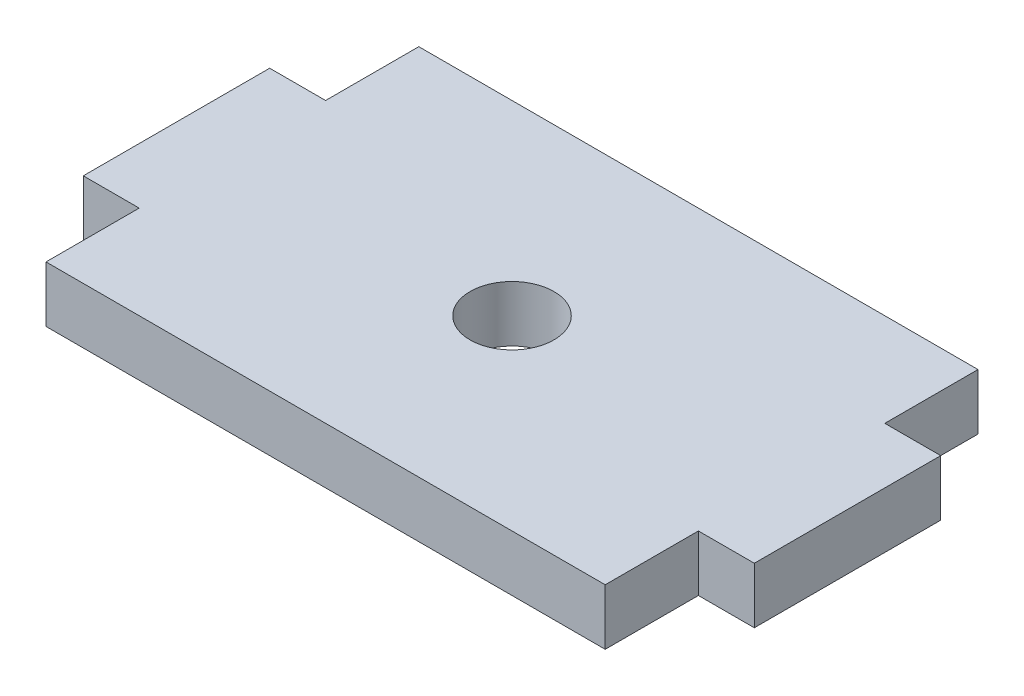
ISO-10303-21;
HEADER;
FILE_DESCRIPTION(('STEP AP214'),'2;1');
FILE_NAME('part.step','',(''),(''),'','','');
FILE_SCHEMA(('AUTOMOTIVE_DESIGN { 1 0 10303 214 1 1 1 1 }'));
ENDSEC;
DATA;
#1=APPLICATION_CONTEXT('core data for automotive mechanical design processes');
#2=APPLICATION_PROTOCOL_DEFINITION('international standard','automotive_design',2000,#1);
#3=PRODUCT_CONTEXT('',#1,'mechanical');
#4=PRODUCT('Part','Part','',(#3));
#5=PRODUCT_RELATED_PRODUCT_CATEGORY('part','',(#4));
#6=PRODUCT_DEFINITION_FORMATION('','',#4);
#7=PRODUCT_DEFINITION_CONTEXT('part definition',#1,'design');
#8=PRODUCT_DEFINITION('design','',#6,#7);
#9=PRODUCT_DEFINITION_SHAPE('','',#8);
#10=(LENGTH_UNIT() NAMED_UNIT(*) SI_UNIT(.MILLI.,.METRE.));
#11=(NAMED_UNIT(*) PLANE_ANGLE_UNIT() SI_UNIT($,.RADIAN.));
#12=(NAMED_UNIT(*) SI_UNIT($,.STERADIAN.) SOLID_ANGLE_UNIT());
#13=UNCERTAINTY_MEASURE_WITH_UNIT(LENGTH_MEASURE(1.E-05),#10,'distance_accuracy_value','');
#14=(GEOMETRIC_REPRESENTATION_CONTEXT(3) GLOBAL_UNCERTAINTY_ASSIGNED_CONTEXT((#13)) GLOBAL_UNIT_ASSIGNED_CONTEXT((#10,
#11,#12)) REPRESENTATION_CONTEXT('',''));
#15=CARTESIAN_POINT('',(0.,0.,0.));
#16=DIRECTION('',(0.,0.,1.));
#17=DIRECTION('',(1.,0.,0.));
#18=AXIS2_PLACEMENT_3D('',#15,#16,#17);
#19=CARTESIAN_POINT('',(0.,3.,0.));
#20=DIRECTION('',(0.,-1.,0.));
#21=DIRECTION('',(0.,0.,-1.));
#22=AXIS2_PLACEMENT_3D('',#19,#20,#21);
#23=PLANE('',#22);
#24=DIRECTION('',(0.,0.,1.));
#25=VECTOR('',#24,1.);
#26=CARTESIAN_POINT('',(-15.,3.,5.));
#27=LINE('',#26,#25);
#28=CARTESIAN_POINT('',(-15.,3.,5.));
#29=VERTEX_POINT('',#28);
#30=CARTESIAN_POINT('',(-15.,3.,10.));
#31=VERTEX_POINT('',#30);
#32=EDGE_CURVE('E177',#29,#31,#27,.T.);
#33=ORIENTED_EDGE('',*,*,#32,.T.);
#34=DIRECTION('',(1.,0.,0.));
#35=VECTOR('',#34,1.);
#36=CARTESIAN_POINT('',(15.,3.,10.));
#37=LINE('',#36,#35);
#38=CARTESIAN_POINT('',(15.,3.,10.));
#39=VERTEX_POINT('',#38);
#40=EDGE_CURVE('E105',#31,#39,#37,.T.);
#41=ORIENTED_EDGE('',*,*,#40,.T.);
#42=DIRECTION('',(0.,0.,-1.));
#43=VECTOR('',#42,1.);
#44=CARTESIAN_POINT('',(15.,3.,10.));
#45=LINE('',#44,#43);
#46=CARTESIAN_POINT('',(15.,3.,5.));
#47=VERTEX_POINT('',#46);
#48=EDGE_CURVE('E204',#39,#47,#45,.T.);
#49=ORIENTED_EDGE('',*,*,#48,.T.);
#50=DIRECTION('',(1.,0.,0.));
#51=VECTOR('',#50,1.);
#52=CARTESIAN_POINT('',(15.,3.,5.));
#53=LINE('',#52,#51);
#54=CARTESIAN_POINT('',(18.,3.,5.));
#55=VERTEX_POINT('',#54);
#56=EDGE_CURVE('E223',#47,#55,#53,.T.);
#57=ORIENTED_EDGE('',*,*,#56,.T.);
#58=DIRECTION('',(0.,0.,-1.));
#59=VECTOR('',#58,1.);
#60=CARTESIAN_POINT('',(18.,3.,5.));
#61=LINE('',#60,#59);
#62=CARTESIAN_POINT('',(18.,3.,-5.));
#63=VERTEX_POINT('',#62);
#64=EDGE_CURVE('E220',#55,#63,#61,.T.);
#65=ORIENTED_EDGE('',*,*,#64,.T.);
#66=DIRECTION('',(-1.,0.,0.));
#67=VECTOR('',#66,1.);
#68=CARTESIAN_POINT('',(18.,3.,-5.));
#69=LINE('',#68,#67);
#70=CARTESIAN_POINT('',(15.,3.,-5.));
#71=VERTEX_POINT('',#70);
#72=EDGE_CURVE('E222',#63,#71,#69,.T.);
#73=ORIENTED_EDGE('',*,*,#72,.T.);
#74=DIRECTION('',(0.,0.,-1.));
#75=VECTOR('',#74,1.);
#76=CARTESIAN_POINT('',(15.,3.,-5.));
#77=LINE('',#76,#75);
#78=CARTESIAN_POINT('',(15.,3.,-10.));
#79=VERTEX_POINT('',#78);
#80=EDGE_CURVE('E225',#71,#79,#77,.T.);
#81=ORIENTED_EDGE('',*,*,#80,.T.);
#82=DIRECTION('',(-1.,0.,0.));
#83=VECTOR('',#82,1.);
#84=CARTESIAN_POINT('',(15.,3.,-10.));
#85=LINE('',#84,#83);
#86=CARTESIAN_POINT('',(-15.,3.,-10.));
#87=VERTEX_POINT('',#86);
#88=EDGE_CURVE('E231',#79,#87,#85,.T.);
#89=ORIENTED_EDGE('',*,*,#88,.T.);
#90=DIRECTION('',(0.,0.,1.));
#91=VECTOR('',#90,1.);
#92=CARTESIAN_POINT('',(-15.,3.,-10.));
#93=LINE('',#92,#91);
#94=CARTESIAN_POINT('',(-15.,3.,-5.));
#95=VERTEX_POINT('',#94);
#96=EDGE_CURVE('E136',#87,#95,#93,.T.);
#97=ORIENTED_EDGE('',*,*,#96,.T.);
#98=DIRECTION('',(-1.,0.,0.));
#99=VECTOR('',#98,1.);
#100=CARTESIAN_POINT('',(-15.,3.,-5.));
#101=LINE('',#100,#99);
#102=CARTESIAN_POINT('',(-18.,3.,-5.));
#103=VERTEX_POINT('',#102);
#104=EDGE_CURVE('E130',#95,#103,#101,.T.);
#105=ORIENTED_EDGE('',*,*,#104,.T.);
#106=DIRECTION('',(0.,0.,1.));
#107=VECTOR('',#106,1.);
#108=CARTESIAN_POINT('',(-18.,3.,-5.));
#109=LINE('',#108,#107);
#110=CARTESIAN_POINT('',(-18.,3.,5.));
#111=VERTEX_POINT('',#110);
#112=EDGE_CURVE('E134',#103,#111,#109,.T.);
#113=ORIENTED_EDGE('',*,*,#112,.T.);
#114=DIRECTION('',(1.,0.,0.));
#115=VECTOR('',#114,1.);
#116=CARTESIAN_POINT('',(-18.,3.,5.));
#117=LINE('',#116,#115);
#118=EDGE_CURVE('E50',#111,#29,#117,.T.);
#119=ORIENTED_EDGE('',*,*,#118,.T.);
#120=EDGE_LOOP('',(#33,#41,#49,#57,#65,#73,#81,#89,#97,#105,#113,#119));
#121=FACE_BOUND('',#120,.T.);
#122=CARTESIAN_POINT('',(0.,3.,0.));
#123=DIRECTION('',(0.,1.,0.));
#124=DIRECTION('',(0.,0.,1.));
#125=AXIS2_PLACEMENT_3D('',#122,#123,#124);
#126=CIRCLE('',#125,2.25);
#127=CARTESIAN_POINT('',(0.,3.,2.25));
#128=VERTEX_POINT('',#127);
#129=EDGE_CURVE('E158',#128,#128,#126,.T.);
#130=ORIENTED_EDGE('',*,*,#129,.F.);
#131=EDGE_LOOP('',(#130));
#132=FACE_BOUND('',#131,.T.);
#133=ADVANCED_FACE('F33',(#121,#132),#23,.F.);
#134=CARTESIAN_POINT('',(0.,0.,0.));
#135=DIRECTION('',(0.,-1.,0.));
#136=DIRECTION('',(0.,0.,-1.));
#137=AXIS2_PLACEMENT_3D('',#134,#135,#136);
#138=PLANE('',#137);
#139=DIRECTION('',(0.,0.,1.));
#140=VECTOR('',#139,1.);
#141=CARTESIAN_POINT('',(-15.,0.,5.));
#142=LINE('',#141,#140);
#143=CARTESIAN_POINT('',(-15.,0.,5.));
#144=VERTEX_POINT('',#143);
#145=CARTESIAN_POINT('',(-15.,0.,10.));
#146=VERTEX_POINT('',#145);
#147=EDGE_CURVE('E154',#144,#146,#142,.T.);
#148=ORIENTED_EDGE('',*,*,#147,.F.);
#149=DIRECTION('',(1.,0.,0.));
#150=VECTOR('',#149,1.);
#151=CARTESIAN_POINT('',(-18.,0.,5.));
#152=LINE('',#151,#150);
#153=CARTESIAN_POINT('',(-18.,0.,5.));
#154=VERTEX_POINT('',#153);
#155=EDGE_CURVE('E97',#154,#144,#152,.T.);
#156=ORIENTED_EDGE('',*,*,#155,.F.);
#157=DIRECTION('',(0.,0.,1.));
#158=VECTOR('',#157,1.);
#159=CARTESIAN_POINT('',(-18.,0.,-5.));
#160=LINE('',#159,#158);
#161=CARTESIAN_POINT('',(-18.,0.,-5.));
#162=VERTEX_POINT('',#161);
#163=EDGE_CURVE('E91',#162,#154,#160,.T.);
#164=ORIENTED_EDGE('',*,*,#163,.F.);
#165=DIRECTION('',(-1.,0.,0.));
#166=VECTOR('',#165,1.);
#167=CARTESIAN_POINT('',(-15.,0.,-5.));
#168=LINE('',#167,#166);
#169=CARTESIAN_POINT('',(-15.,0.,-5.));
#170=VERTEX_POINT('',#169);
#171=EDGE_CURVE('E144',#170,#162,#168,.T.);
#172=ORIENTED_EDGE('',*,*,#171,.F.);
#173=DIRECTION('',(0.,0.,1.));
#174=VECTOR('',#173,1.);
#175=CARTESIAN_POINT('',(-15.,0.,-10.));
#176=LINE('',#175,#174);
#177=CARTESIAN_POINT('',(-15.,0.,-10.));
#178=VERTEX_POINT('',#177);
#179=EDGE_CURVE('E172',#178,#170,#176,.T.);
#180=ORIENTED_EDGE('',*,*,#179,.F.);
#181=DIRECTION('',(-1.,0.,0.));
#182=VECTOR('',#181,1.);
#183=CARTESIAN_POINT('',(15.,0.,-10.));
#184=LINE('',#183,#182);
#185=CARTESIAN_POINT('',(15.,0.,-10.));
#186=VERTEX_POINT('',#185);
#187=EDGE_CURVE('E170',#186,#178,#184,.T.);
#188=ORIENTED_EDGE('',*,*,#187,.F.);
#189=DIRECTION('',(0.,0.,-1.));
#190=VECTOR('',#189,1.);
#191=CARTESIAN_POINT('',(15.,0.,-5.));
#192=LINE('',#191,#190);
#193=CARTESIAN_POINT('',(15.,0.,-5.));
#194=VERTEX_POINT('',#193);
#195=EDGE_CURVE('E168',#194,#186,#192,.T.);
#196=ORIENTED_EDGE('',*,*,#195,.F.);
#197=DIRECTION('',(-1.,0.,0.));
#198=VECTOR('',#197,1.);
#199=CARTESIAN_POINT('',(18.,0.,-5.));
#200=LINE('',#199,#198);
#201=CARTESIAN_POINT('',(18.,0.,-5.));
#202=VERTEX_POINT('',#201);
#203=EDGE_CURVE('E166',#202,#194,#200,.T.);
#204=ORIENTED_EDGE('',*,*,#203,.F.);
#205=DIRECTION('',(0.,0.,-1.));
#206=VECTOR('',#205,1.);
#207=CARTESIAN_POINT('',(18.,0.,5.));
#208=LINE('',#207,#206);
#209=CARTESIAN_POINT('',(18.,0.,5.));
#210=VERTEX_POINT('',#209);
#211=EDGE_CURVE('E164',#210,#202,#208,.T.);
#212=ORIENTED_EDGE('',*,*,#211,.F.);
#213=DIRECTION('',(1.,0.,0.));
#214=VECTOR('',#213,1.);
#215=CARTESIAN_POINT('',(15.,0.,5.));
#216=LINE('',#215,#214);
#217=CARTESIAN_POINT('',(15.,0.,5.));
#218=VERTEX_POINT('',#217);
#219=EDGE_CURVE('E162',#218,#210,#216,.T.);
#220=ORIENTED_EDGE('',*,*,#219,.F.);
#221=DIRECTION('',(0.,0.,-1.));
#222=VECTOR('',#221,1.);
#223=CARTESIAN_POINT('',(15.,0.,10.));
#224=LINE('',#223,#222);
#225=CARTESIAN_POINT('',(15.,0.,10.));
#226=VERTEX_POINT('',#225);
#227=EDGE_CURVE('E160',#226,#218,#224,.T.);
#228=ORIENTED_EDGE('',*,*,#227,.F.);
#229=DIRECTION('',(1.,0.,0.));
#230=VECTOR('',#229,1.);
#231=CARTESIAN_POINT('',(15.,0.,10.));
#232=LINE('',#231,#230);
#233=EDGE_CURVE('E157',#146,#226,#232,.T.);
#234=ORIENTED_EDGE('',*,*,#233,.F.);
#235=EDGE_LOOP('',(#148,#156,#164,#172,#180,#188,#196,#204,#212,#220,#228,#234));
#236=FACE_BOUND('',#235,.T.);
#237=CARTESIAN_POINT('',(0.,0.,0.));
#238=DIRECTION('',(0.,1.,0.));
#239=DIRECTION('',(0.,0.,1.));
#240=AXIS2_PLACEMENT_3D('',#237,#238,#239);
#241=CIRCLE('',#240,2.25);
#242=CARTESIAN_POINT('',(0.,0.,2.25));
#243=VERTEX_POINT('',#242);
#244=EDGE_CURVE('E378',#243,#243,#241,.T.);
#245=ORIENTED_EDGE('',*,*,#244,.T.);
#246=EDGE_LOOP('',(#245));
#247=FACE_BOUND('',#246,.T.);
#248=ADVANCED_FACE('F208',(#236,#247),#138,.T.);
#249=CARTESIAN_POINT('',(-15.,3.,5.));
#250=DIRECTION('',(1.,0.,0.));
#251=DIRECTION('',(0.,0.,-1.));
#252=AXIS2_PLACEMENT_3D('',#249,#250,#251);
#253=PLANE('',#252);
#254=ORIENTED_EDGE('',*,*,#147,.T.);
#255=DIRECTION('',(0.,-1.,0.));
#256=VECTOR('',#255,1.);
#257=CARTESIAN_POINT('',(-15.,3.,10.));
#258=LINE('',#257,#256);
#259=EDGE_CURVE('E11',#31,#146,#258,.T.);
#260=ORIENTED_EDGE('',*,*,#259,.F.);
#261=ORIENTED_EDGE('',*,*,#32,.F.);
#262=DIRECTION('',(0.,-1.,0.));
#263=VECTOR('',#262,1.);
#264=CARTESIAN_POINT('',(-15.,3.,5.));
#265=LINE('',#264,#263);
#266=EDGE_CURVE('E150',#29,#144,#265,.T.);
#267=ORIENTED_EDGE('',*,*,#266,.T.);
#268=EDGE_LOOP('',(#254,#260,#261,#267));
#269=FACE_BOUND('',#268,.T.);
#270=ADVANCED_FACE('F35',(#269),#253,.F.);
#271=CARTESIAN_POINT('',(15.,3.,10.));
#272=DIRECTION('',(0.,0.,-1.));
#273=DIRECTION('',(-1.,0.,0.));
#274=AXIS2_PLACEMENT_3D('',#271,#272,#273);
#275=PLANE('',#274);
#276=ORIENTED_EDGE('',*,*,#233,.T.);
#277=DIRECTION('',(0.,-1.,0.));
#278=VECTOR('',#277,1.);
#279=CARTESIAN_POINT('',(15.,3.,10.));
#280=LINE('',#279,#278);
#281=EDGE_CURVE('E42',#39,#226,#280,.T.);
#282=ORIENTED_EDGE('',*,*,#281,.F.);
#283=ORIENTED_EDGE('',*,*,#40,.F.);
#284=ORIENTED_EDGE('',*,*,#259,.T.);
#285=EDGE_LOOP('',(#276,#282,#283,#284));
#286=FACE_BOUND('',#285,.T.);
#287=ADVANCED_FACE('F265',(#286),#275,.F.);
#288=CARTESIAN_POINT('',(15.,3.,10.));
#289=DIRECTION('',(-1.,0.,0.));
#290=DIRECTION('',(0.,0.,1.));
#291=AXIS2_PLACEMENT_3D('',#288,#289,#290);
#292=PLANE('',#291);
#293=ORIENTED_EDGE('',*,*,#227,.T.);
#294=DIRECTION('',(0.,-1.,0.));
#295=VECTOR('',#294,1.);
#296=CARTESIAN_POINT('',(15.,3.,5.));
#297=LINE('',#296,#295);
#298=EDGE_CURVE('E196',#47,#218,#297,.T.);
#299=ORIENTED_EDGE('',*,*,#298,.F.);
#300=ORIENTED_EDGE('',*,*,#48,.F.);
#301=ORIENTED_EDGE('',*,*,#281,.T.);
#302=EDGE_LOOP('',(#293,#299,#300,#301));
#303=FACE_BOUND('',#302,.T.);
#304=ADVANCED_FACE('F202',(#303),#292,.F.);
#305=CARTESIAN_POINT('',(15.,3.,5.));
#306=DIRECTION('',(0.,0.,-1.));
#307=DIRECTION('',(-1.,0.,0.));
#308=AXIS2_PLACEMENT_3D('',#305,#306,#307);
#309=PLANE('',#308);
#310=ORIENTED_EDGE('',*,*,#219,.T.);
#311=DIRECTION('',(0.,-1.,0.));
#312=VECTOR('',#311,1.);
#313=CARTESIAN_POINT('',(18.,3.,5.));
#314=LINE('',#313,#312);
#315=EDGE_CURVE('E193',#55,#210,#314,.T.);
#316=ORIENTED_EDGE('',*,*,#315,.F.);
#317=ORIENTED_EDGE('',*,*,#56,.F.);
#318=ORIENTED_EDGE('',*,*,#298,.T.);
#319=EDGE_LOOP('',(#310,#316,#317,#318));
#320=FACE_BOUND('',#319,.T.);
#321=ADVANCED_FACE('F214',(#320),#309,.F.);
#322=CARTESIAN_POINT('',(18.,3.,5.));
#323=DIRECTION('',(-1.,0.,0.));
#324=DIRECTION('',(0.,0.,1.));
#325=AXIS2_PLACEMENT_3D('',#322,#323,#324);
#326=PLANE('',#325);
#327=ORIENTED_EDGE('',*,*,#211,.T.);
#328=DIRECTION('',(0.,-1.,0.));
#329=VECTOR('',#328,1.);
#330=CARTESIAN_POINT('',(18.,3.,-5.));
#331=LINE('',#330,#329);
#332=EDGE_CURVE('E190',#63,#202,#331,.T.);
#333=ORIENTED_EDGE('',*,*,#332,.F.);
#334=ORIENTED_EDGE('',*,*,#64,.F.);
#335=ORIENTED_EDGE('',*,*,#315,.T.);
#336=EDGE_LOOP('',(#327,#333,#334,#335));
#337=FACE_BOUND('',#336,.T.);
#338=ADVANCED_FACE('F218',(#337),#326,.F.);
#339=CARTESIAN_POINT('',(18.,3.,-5.));
#340=DIRECTION('',(0.,0.,1.));
#341=DIRECTION('',(1.,0.,0.));
#342=AXIS2_PLACEMENT_3D('',#339,#340,#341);
#343=PLANE('',#342);
#344=ORIENTED_EDGE('',*,*,#203,.T.);
#345=DIRECTION('',(0.,-1.,0.));
#346=VECTOR('',#345,1.);
#347=CARTESIAN_POINT('',(15.,3.,-5.));
#348=LINE('',#347,#346);
#349=EDGE_CURVE('E187',#71,#194,#348,.T.);
#350=ORIENTED_EDGE('',*,*,#349,.F.);
#351=ORIENTED_EDGE('',*,*,#72,.F.);
#352=ORIENTED_EDGE('',*,*,#332,.T.);
#353=EDGE_LOOP('',(#344,#350,#351,#352));
#354=FACE_BOUND('',#353,.T.);
#355=ADVANCED_FACE('F278',(#354),#343,.F.);
#356=CARTESIAN_POINT('',(15.,3.,-5.));
#357=DIRECTION('',(-1.,0.,0.));
#358=DIRECTION('',(0.,0.,1.));
#359=AXIS2_PLACEMENT_3D('',#356,#357,#358);
#360=PLANE('',#359);
#361=ORIENTED_EDGE('',*,*,#195,.T.);
#362=DIRECTION('',(0.,-1.,0.));
#363=VECTOR('',#362,1.);
#364=CARTESIAN_POINT('',(15.,3.,-10.));
#365=LINE('',#364,#363);
#366=EDGE_CURVE('E184',#79,#186,#365,.T.);
#367=ORIENTED_EDGE('',*,*,#366,.F.);
#368=ORIENTED_EDGE('',*,*,#80,.F.);
#369=ORIENTED_EDGE('',*,*,#349,.T.);
#370=EDGE_LOOP('',(#361,#367,#368,#369));
#371=FACE_BOUND('',#370,.T.);
#372=ADVANCED_FACE('F281',(#371),#360,.F.);
#373=CARTESIAN_POINT('',(15.,3.,-10.));
#374=DIRECTION('',(0.,0.,1.));
#375=DIRECTION('',(1.,0.,0.));
#376=AXIS2_PLACEMENT_3D('',#373,#374,#375);
#377=PLANE('',#376);
#378=ORIENTED_EDGE('',*,*,#187,.T.);
#379=DIRECTION('',(0.,-1.,0.));
#380=VECTOR('',#379,1.);
#381=CARTESIAN_POINT('',(-15.,3.,-10.));
#382=LINE('',#381,#380);
#383=EDGE_CURVE('E181',#87,#178,#382,.T.);
#384=ORIENTED_EDGE('',*,*,#383,.F.);
#385=ORIENTED_EDGE('',*,*,#88,.F.);
#386=ORIENTED_EDGE('',*,*,#366,.T.);
#387=EDGE_LOOP('',(#378,#384,#385,#386));
#388=FACE_BOUND('',#387,.T.);
#389=ADVANCED_FACE('F237',(#388),#377,.F.);
#390=CARTESIAN_POINT('',(-15.,3.,-10.));
#391=DIRECTION('',(1.,0.,0.));
#392=DIRECTION('',(0.,0.,-1.));
#393=AXIS2_PLACEMENT_3D('',#390,#391,#392);
#394=PLANE('',#393);
#395=ORIENTED_EDGE('',*,*,#179,.T.);
#396=DIRECTION('',(0.,-1.,0.));
#397=VECTOR('',#396,1.);
#398=CARTESIAN_POINT('',(-15.,3.,-5.));
#399=LINE('',#398,#397);
#400=EDGE_CURVE('E145',#95,#170,#399,.T.);
#401=ORIENTED_EDGE('',*,*,#400,.F.);
#402=ORIENTED_EDGE('',*,*,#96,.F.);
#403=ORIENTED_EDGE('',*,*,#383,.T.);
#404=EDGE_LOOP('',(#395,#401,#402,#403));
#405=FACE_BOUND('',#404,.T.);
#406=ADVANCED_FACE('F241',(#405),#394,.F.);
#407=CARTESIAN_POINT('',(-15.,3.,-5.));
#408=DIRECTION('',(0.,0.,1.));
#409=DIRECTION('',(1.,0.,0.));
#410=AXIS2_PLACEMENT_3D('',#407,#408,#409);
#411=PLANE('',#410);
#412=ORIENTED_EDGE('',*,*,#171,.T.);
#413=DIRECTION('',(0.,-1.,0.));
#414=VECTOR('',#413,1.);
#415=CARTESIAN_POINT('',(-18.,3.,-5.));
#416=LINE('',#415,#414);
#417=EDGE_CURVE('E141',#103,#162,#416,.T.);
#418=ORIENTED_EDGE('',*,*,#417,.F.);
#419=ORIENTED_EDGE('',*,*,#104,.F.);
#420=ORIENTED_EDGE('',*,*,#400,.T.);
#421=EDGE_LOOP('',(#412,#418,#419,#420));
#422=FACE_BOUND('',#421,.T.);
#423=ADVANCED_FACE('F142',(#422),#411,.F.);
#424=CARTESIAN_POINT('',(-18.,3.,-5.));
#425=DIRECTION('',(1.,0.,0.));
#426=DIRECTION('',(0.,0.,-1.));
#427=AXIS2_PLACEMENT_3D('',#424,#425,#426);
#428=PLANE('',#427);
#429=ORIENTED_EDGE('',*,*,#163,.T.);
#430=DIRECTION('',(0.,-1.,0.));
#431=VECTOR('',#430,1.);
#432=CARTESIAN_POINT('',(-18.,3.,5.));
#433=LINE('',#432,#431);
#434=EDGE_CURVE('E146',#111,#154,#433,.T.);
#435=ORIENTED_EDGE('',*,*,#434,.F.);
#436=ORIENTED_EDGE('',*,*,#112,.F.);
#437=ORIENTED_EDGE('',*,*,#417,.T.);
#438=EDGE_LOOP('',(#429,#435,#436,#437));
#439=FACE_BOUND('',#438,.T.);
#440=ADVANCED_FACE('F148',(#439),#428,.F.);
#441=CARTESIAN_POINT('',(-18.,3.,5.));
#442=DIRECTION('',(0.,0.,-1.));
#443=DIRECTION('',(-1.,0.,0.));
#444=AXIS2_PLACEMENT_3D('',#441,#442,#443);
#445=PLANE('',#444);
#446=ORIENTED_EDGE('',*,*,#155,.T.);
#447=ORIENTED_EDGE('',*,*,#266,.F.);
#448=ORIENTED_EDGE('',*,*,#118,.F.);
#449=ORIENTED_EDGE('',*,*,#434,.T.);
#450=EDGE_LOOP('',(#446,#447,#448,#449));
#451=FACE_BOUND('',#450,.T.);
#452=ADVANCED_FACE('F245',(#451),#445,.F.);
#453=CARTESIAN_POINT('',(0.,3.,0.));
#454=DIRECTION('',(0.,-1.,0.));
#455=DIRECTION('',(0.,0.,-1.));
#456=AXIS2_PLACEMENT_3D('',#453,#454,#455);
#457=CYLINDRICAL_SURFACE('',#456,2.25);
#458=ORIENTED_EDGE('',*,*,#129,.T.);
#459=EDGE_LOOP('',(#458));
#460=FACE_BOUND('',#459,.T.);
#461=ORIENTED_EDGE('',*,*,#244,.F.);
#462=EDGE_LOOP('',(#461));
#463=FACE_BOUND('',#462,.T.);
#464=ADVANCED_FACE('F247',(#460,#463),#457,.F.);
#465=CLOSED_SHELL('',(#133,#248,#270,#287,#304,#321,#338,#355,#372,#389,#406,#423,#440,#452,#464));
#466=MANIFOLD_SOLID_BREP('B2',#465);
#467=ADVANCED_BREP_SHAPE_REPRESENTATION('',(#18,#466),#14);
#468=SHAPE_DEFINITION_REPRESENTATION(#9,#467);
ENDSEC;
END-ISO-10303-21;
